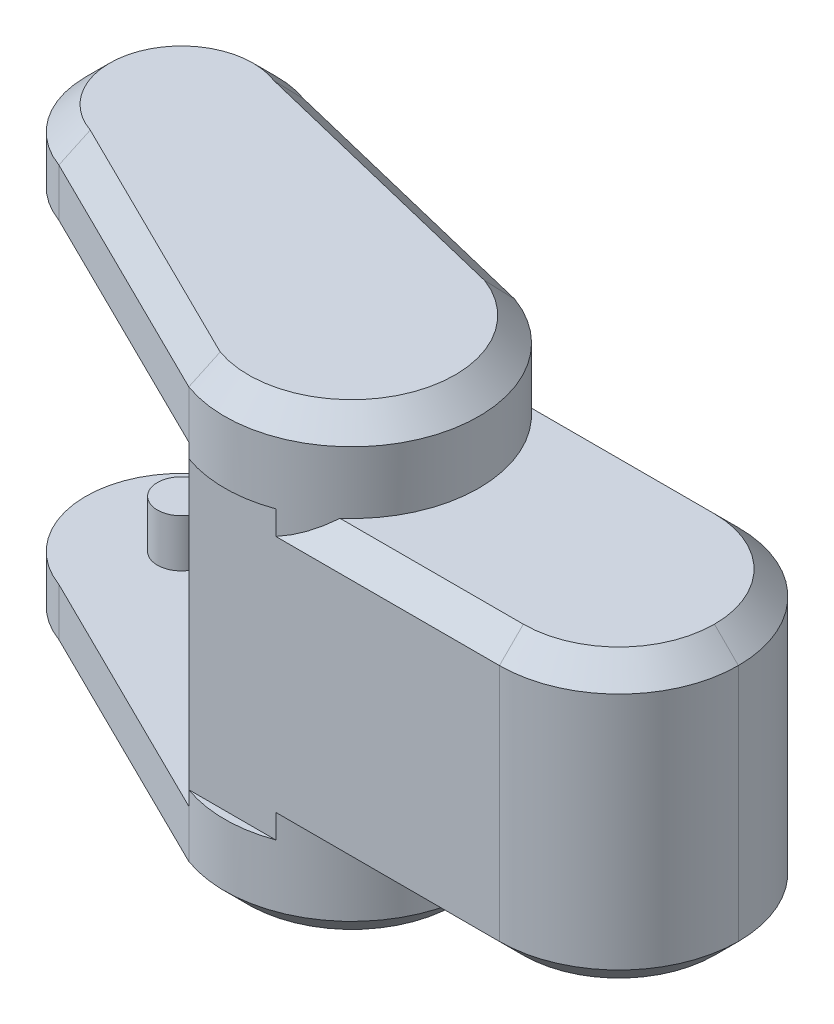
ISO-10303-21;
HEADER;
FILE_DESCRIPTION(('STEP AP214'),'2;1');
FILE_NAME('part.step','',(''),(''),'','','');
FILE_SCHEMA(('AUTOMOTIVE_DESIGN { 1 0 10303 214 1 1 1 1 }'));
ENDSEC;
DATA;
#1=APPLICATION_CONTEXT('core data for automotive mechanical design processes');
#2=APPLICATION_PROTOCOL_DEFINITION('international standard','automotive_design',2000,#1);
#3=PRODUCT_CONTEXT('',#1,'mechanical');
#4=PRODUCT('Part','Part','',(#3));
#5=PRODUCT_RELATED_PRODUCT_CATEGORY('part','',(#4));
#6=PRODUCT_DEFINITION_FORMATION('','',#4);
#7=PRODUCT_DEFINITION_CONTEXT('part definition',#1,'design');
#8=PRODUCT_DEFINITION('design','',#6,#7);
#9=PRODUCT_DEFINITION_SHAPE('','',#8);
#10=(LENGTH_UNIT() NAMED_UNIT(*) SI_UNIT(.MILLI.,.METRE.));
#11=(NAMED_UNIT(*) PLANE_ANGLE_UNIT() SI_UNIT($,.RADIAN.));
#12=(NAMED_UNIT(*) SI_UNIT($,.STERADIAN.) SOLID_ANGLE_UNIT());
#13=UNCERTAINTY_MEASURE_WITH_UNIT(LENGTH_MEASURE(1.E-05),#10,'distance_accuracy_value','');
#14=(GEOMETRIC_REPRESENTATION_CONTEXT(3) GLOBAL_UNCERTAINTY_ASSIGNED_CONTEXT((#13)) GLOBAL_UNIT_ASSIGNED_CONTEXT((#10,
#11,#12)) REPRESENTATION_CONTEXT('',''));
#15=CARTESIAN_POINT('',(0.,0.,0.));
#16=DIRECTION('',(0.,0.,1.));
#17=DIRECTION('',(1.,0.,0.));
#18=AXIS2_PLACEMENT_3D('',#15,#16,#17);
#19=CARTESIAN_POINT('',(0.,60.,0.));
#20=DIRECTION('',(0.939692620785907,0.,0.342020143325672));
#21=DIRECTION('',(0.342020143325672,0.,-0.939692620785907));
#22=AXIS2_PLACEMENT_3D('',#19,#20,#21);
#23=PLANE('',#22);
#24=DIRECTION('',(-0.342020143325673,0.,0.939692620785907));
#25=VECTOR('',#24,1.);
#26=CARTESIAN_POINT('',(0.,-3.,0.));
#27=LINE('',#26,#25);
#28=CARTESIAN_POINT('',(18.1985117133103,-3.,-50.));
#29=VERTEX_POINT('',#28);
#30=CARTESIAN_POINT('',(0.,-3.,0.));
#31=VERTEX_POINT('',#30);
#32=EDGE_CURVE('E223',#29,#31,#27,.T.);
#33=ORIENTED_EDGE('',*,*,#32,.T.);
#34=DIRECTION('',(0.,1.,0.));
#35=VECTOR('',#34,1.);
#36=CARTESIAN_POINT('',(0.,-18.,0.));
#37=LINE('',#36,#35);
#38=CARTESIAN_POINT('',(0.,0.,0.));
#39=VERTEX_POINT('',#38);
#40=EDGE_CURVE('E245',#31,#39,#37,.T.);
#41=ORIENTED_EDGE('',*,*,#40,.T.);
#42=DIRECTION('',(0.,-1.,0.));
#43=VECTOR('',#42,1.);
#44=CARTESIAN_POINT('',(0.,60.,0.));
#45=LINE('',#44,#43);
#46=CARTESIAN_POINT('',(0.,60.,0.));
#47=VERTEX_POINT('',#46);
#48=EDGE_CURVE('E282',#47,#39,#45,.T.);
#49=ORIENTED_EDGE('',*,*,#48,.F.);
#50=DIRECTION('',(0.,1.,0.));
#51=VECTOR('',#50,1.);
#52=CARTESIAN_POINT('',(0.,-2.75167630004557,0.));
#53=LINE('',#52,#51);
#54=CARTESIAN_POINT('',(0.,63.,0.));
#55=VERTEX_POINT('',#54);
#56=EDGE_CURVE('E263',#47,#55,#53,.T.);
#57=ORIENTED_EDGE('',*,*,#56,.T.);
#58=DIRECTION('',(-0.342020143325673,0.,0.939692620785907));
#59=VECTOR('',#58,1.);
#60=CARTESIAN_POINT('',(18.1985117133103,63.,-50.));
#61=LINE('',#60,#59);
#62=CARTESIAN_POINT('',(18.1985117133103,63.,-50.));
#63=VERTEX_POINT('',#62);
#64=EDGE_CURVE('E254',#63,#55,#61,.T.);
#65=ORIENTED_EDGE('',*,*,#64,.F.);
#66=DIRECTION('',(0.,-1.,0.));
#67=VECTOR('',#66,1.);
#68=CARTESIAN_POINT('',(18.1985117133103,60.,-50.));
#69=LINE('',#68,#67);
#70=CARTESIAN_POINT('',(18.1985117133103,54.9999999999999,-50.));
#71=VERTEX_POINT('',#70);
#72=EDGE_CURVE('E288',#63,#71,#69,.T.);
#73=ORIENTED_EDGE('',*,*,#72,.T.);
#74=CARTESIAN_POINT('',(18.1985117133103,5.00000000000003,-50.));
#75=VERTEX_POINT('',#74);
#76=EDGE_CURVE('E287',#71,#75,#69,.T.);
#77=ORIENTED_EDGE('',*,*,#76,.T.);
#78=DIRECTION('',(0.,1.,0.));
#79=VECTOR('',#78,1.);
#80=CARTESIAN_POINT('',(18.1985117133103,-18.,-50.));
#81=LINE('',#80,#79);
#82=EDGE_CURVE('E242',#29,#75,#81,.T.);
#83=ORIENTED_EDGE('',*,*,#82,.F.);
#84=EDGE_LOOP('',(#33,#41,#49,#57,#65,#73,#77,#83));
#85=FACE_BOUND('',#84,.T.);
#86=ADVANCED_FACE('F39',(#85),#23,.F.);
#87=CARTESIAN_POINT('',(90.,60.,0.));
#88=DIRECTION('',(0.,0.,-1.));
#89=DIRECTION('',(-1.,0.,0.));
#90=AXIS2_PLACEMENT_3D('',#87,#88,#89);
#91=PLANE('',#90);
#92=DIRECTION('',(0.,1.,0.));
#93=VECTOR('',#92,1.);
#94=CARTESIAN_POINT('',(18.1985117133103,0.,0.));
#95=LINE('',#94,#93);
#96=CARTESIAN_POINT('',(18.1985117133103,0.,0.));
#97=VERTEX_POINT('',#96);
#98=CARTESIAN_POINT('',(18.1985117133103,5.00000000000003,0.));
#99=VERTEX_POINT('',#98);
#100=EDGE_CURVE('E56',#97,#99,#95,.T.);
#101=ORIENTED_EDGE('',*,*,#100,.T.);
#102=DIRECTION('',(1.,0.,0.));
#103=VECTOR('',#102,1.);
#104=CARTESIAN_POINT('',(90.,5.00000000000003,0.));
#105=LINE('',#104,#103);
#106=CARTESIAN_POINT('',(65.,5.00000000000003,0.));
#107=VERTEX_POINT('',#106);
#108=EDGE_CURVE('E344',#99,#107,#105,.T.);
#109=ORIENTED_EDGE('',*,*,#108,.T.);
#110=DIRECTION('',(0.,-1.,0.));
#111=VECTOR('',#110,1.);
#112=CARTESIAN_POINT('',(65.,60.,0.));
#113=LINE('',#112,#111);
#114=CARTESIAN_POINT('',(65.,54.9999999999999,0.));
#115=VERTEX_POINT('',#114);
#116=EDGE_CURVE('E291',#107,#115,#113,.F.);
#117=ORIENTED_EDGE('',*,*,#116,.T.);
#118=DIRECTION('',(-1.,0.,0.));
#119=VECTOR('',#118,1.);
#120=CARTESIAN_POINT('',(18.1985117133103,54.9999999999999,0.));
#121=LINE('',#120,#119);
#122=CARTESIAN_POINT('',(18.1985117133103,54.9999999999999,0.));
#123=VERTEX_POINT('',#122);
#124=EDGE_CURVE('E340',#115,#123,#121,.T.);
#125=ORIENTED_EDGE('',*,*,#124,.T.);
#126=DIRECTION('',(0.,1.,0.));
#127=VECTOR('',#126,1.);
#128=CARTESIAN_POINT('',(18.1985117133103,54.9999999999999,0.));
#129=LINE('',#128,#127);
#130=CARTESIAN_POINT('',(18.1985117133103,60.,0.));
#131=VERTEX_POINT('',#130);
#132=EDGE_CURVE('E338',#123,#131,#129,.T.);
#133=ORIENTED_EDGE('',*,*,#132,.T.);
#134=DIRECTION('',(1.,0.,0.));
#135=VECTOR('',#134,1.);
#136=CARTESIAN_POINT('',(90.,60.,0.));
#137=LINE('',#136,#135);
#138=EDGE_CURVE('E279',#47,#131,#137,.T.);
#139=ORIENTED_EDGE('',*,*,#138,.F.);
#140=ORIENTED_EDGE('',*,*,#48,.T.);
#141=DIRECTION('',(1.,0.,0.));
#142=VECTOR('',#141,1.);
#143=CARTESIAN_POINT('',(90.,0.,0.));
#144=LINE('',#143,#142);
#145=EDGE_CURVE('E283',#39,#97,#144,.T.);
#146=ORIENTED_EDGE('',*,*,#145,.T.);
#147=EDGE_LOOP('',(#101,#109,#117,#125,#133,#139,#140,#146));
#148=FACE_BOUND('',#147,.T.);
#149=ADVANCED_FACE('F543',(#148),#91,.F.);
#150=CARTESIAN_POINT('',(18.1985117133103,60.,-50.));
#151=DIRECTION('',(0.,0.,1.));
#152=DIRECTION('',(1.,0.,0.));
#153=AXIS2_PLACEMENT_3D('',#150,#151,#152);
#154=PLANE('',#153);
#155=DIRECTION('',(0.,-1.,0.));
#156=VECTOR('',#155,1.);
#157=CARTESIAN_POINT('',(65.,60.,-50.));
#158=LINE('',#157,#156);
#159=CARTESIAN_POINT('',(65.,54.9999999999999,-50.));
#160=VERTEX_POINT('',#159);
#161=CARTESIAN_POINT('',(65.,5.00000000000003,-50.));
#162=VERTEX_POINT('',#161);
#163=EDGE_CURVE('E294',#160,#162,#158,.T.);
#164=ORIENTED_EDGE('',*,*,#163,.T.);
#165=DIRECTION('',(-1.,0.,0.));
#166=VECTOR('',#165,1.);
#167=CARTESIAN_POINT('',(18.1985117133103,5.00000000000003,-50.));
#168=LINE('',#167,#166);
#169=EDGE_CURVE('E319',#162,#75,#168,.T.);
#170=ORIENTED_EDGE('',*,*,#169,.T.);
#171=ORIENTED_EDGE('',*,*,#76,.F.);
#172=DIRECTION('',(1.,0.,0.));
#173=VECTOR('',#172,1.);
#174=CARTESIAN_POINT('',(65.,54.9999999999999,-50.));
#175=LINE('',#174,#173);
#176=EDGE_CURVE('E317',#71,#160,#175,.T.);
#177=ORIENTED_EDGE('',*,*,#176,.T.);
#178=EDGE_LOOP('',(#164,#170,#171,#177));
#179=FACE_BOUND('',#178,.T.);
#180=ADVANCED_FACE('F520',(#179),#154,.F.);
#181=CARTESIAN_POINT('',(0.,60.,0.));
#182=DIRECTION('',(0.,1.,0.));
#183=DIRECTION('',(0.,0.,1.));
#184=AXIS2_PLACEMENT_3D('',#181,#182,#183);
#185=PLANE('',#184);
#186=CARTESIAN_POINT('',(65.,60.,-25.));
#187=DIRECTION('',(0.,1.,0.));
#188=DIRECTION('',(0.,0.,1.));
#189=AXIS2_PLACEMENT_3D('',#186,#187,#188);
#190=CIRCLE('',#189,20.);
#191=CARTESIAN_POINT('',(85.,60.,-25.));
#192=VERTEX_POINT('',#191);
#193=CARTESIAN_POINT('',(65.,60.,-45.));
#194=VERTEX_POINT('',#193);
#195=EDGE_CURVE('E350',#192,#194,#190,.T.);
#196=ORIENTED_EDGE('',*,*,#195,.T.);
#197=DIRECTION('',(-1.,0.,0.));
#198=VECTOR('',#197,1.);
#199=CARTESIAN_POINT('',(18.1985117133103,60.,-45.));
#200=LINE('',#199,#198);
#201=CARTESIAN_POINT('',(26.6433847077801,60.,-45.));
#202=VERTEX_POINT('',#201);
#203=EDGE_CURVE('E352',#194,#202,#200,.T.);
#204=ORIENTED_EDGE('',*,*,#203,.T.);
#205=CARTESIAN_POINT('',(9.09925585665517,60.,-25.));
#206=DIRECTION('',(0.,1.,0.));
#207=DIRECTION('',(0.,0.,1.));
#208=AXIS2_PLACEMENT_3D('',#205,#206,#207);
#209=CIRCLE('',#208,26.6044443118978);
#210=CARTESIAN_POINT('',(26.6433847077801,60.,-5.00000000000002));
#211=VERTEX_POINT('',#210);
#212=EDGE_CURVE('E272',#202,#211,#209,.F.);
#213=ORIENTED_EDGE('',*,*,#212,.T.);
#214=DIRECTION('',(1.,0.,0.));
#215=VECTOR('',#214,1.);
#216=CARTESIAN_POINT('',(65.,60.,-5.00000000000003));
#217=LINE('',#216,#215);
#218=CARTESIAN_POINT('',(65.,60.,-5.00000000000003));
#219=VERTEX_POINT('',#218);
#220=EDGE_CURVE('E346',#211,#219,#217,.T.);
#221=ORIENTED_EDGE('',*,*,#220,.T.);
#222=CARTESIAN_POINT('',(65.,60.,-25.));
#223=DIRECTION('',(0.,1.,0.));
#224=DIRECTION('',(0.,0.,1.));
#225=AXIS2_PLACEMENT_3D('',#222,#223,#224);
#226=CIRCLE('',#225,20.);
#227=EDGE_CURVE('E348',#219,#192,#226,.T.);
#228=ORIENTED_EDGE('',*,*,#227,.T.);
#229=EDGE_LOOP('',(#196,#204,#213,#221,#228));
#230=FACE_BOUND('',#229,.T.);
#231=ADVANCED_FACE('F573',(#230),#185,.T.);
#232=CARTESIAN_POINT('',(0.,0.,0.));
#233=DIRECTION('',(0.,1.,0.));
#234=DIRECTION('',(0.,0.,1.));
#235=AXIS2_PLACEMENT_3D('',#232,#233,#234);
#236=PLANE('',#235);
#237=CARTESIAN_POINT('',(65.,0.,-25.));
#238=DIRECTION('',(0.,-1.,0.));
#239=DIRECTION('',(0.,0.,-1.));
#240=AXIS2_PLACEMENT_3D('',#237,#238,#239);
#241=CIRCLE('',#240,5.);
#242=CARTESIAN_POINT('',(65.,0.,-30.));
#243=VERTEX_POINT('',#242);
#244=EDGE_CURVE('E232',#243,#243,#241,.T.);
#245=ORIENTED_EDGE('',*,*,#244,.F.);
#246=EDGE_LOOP('',(#245));
#247=FACE_BOUND('',#246,.T.);
#248=CARTESIAN_POINT('',(9.09925585665517,0.,-25.));
#249=DIRECTION('',(0.,-1.,0.));
#250=DIRECTION('',(0.,0.,1.));
#251=AXIS2_PLACEMENT_3D('',#248,#249,#250);
#252=CIRCLE('',#251,26.6044443118978);
#253=CARTESIAN_POINT('',(26.6433847077802,0.,-44.9999999999999));
#254=VERTEX_POINT('',#253);
#255=CARTESIAN_POINT('',(26.6433847077801,0.,-5.00000000000005));
#256=VERTEX_POINT('',#255);
#257=EDGE_CURVE('E239',#254,#256,#252,.T.);
#258=ORIENTED_EDGE('',*,*,#257,.F.);
#259=DIRECTION('',(1.,0.,0.));
#260=VECTOR('',#259,1.);
#261=CARTESIAN_POINT('',(0.,0.,-44.9999999999999));
#262=LINE('',#261,#260);
#263=CARTESIAN_POINT('',(65.,0.,-44.9999999999999));
#264=VERTEX_POINT('',#263);
#265=EDGE_CURVE('E328',#254,#264,#262,.T.);
#266=ORIENTED_EDGE('',*,*,#265,.T.);
#267=CARTESIAN_POINT('',(65.,0.,-25.));
#268=DIRECTION('',(0.,1.,0.));
#269=DIRECTION('',(0.,0.,1.));
#270=AXIS2_PLACEMENT_3D('',#267,#268,#269);
#271=CIRCLE('',#270,19.9999999999999);
#272=CARTESIAN_POINT('',(84.9999999999999,0.,-25.));
#273=VERTEX_POINT('',#272);
#274=EDGE_CURVE('E326',#264,#273,#271,.F.);
#275=ORIENTED_EDGE('',*,*,#274,.T.);
#276=CARTESIAN_POINT('',(65.,0.,-25.));
#277=DIRECTION('',(0.,1.,0.));
#278=DIRECTION('',(0.,0.,1.));
#279=AXIS2_PLACEMENT_3D('',#276,#277,#278);
#280=CIRCLE('',#279,19.9999999999999);
#281=CARTESIAN_POINT('',(65.,0.,-5.00000000000006));
#282=VERTEX_POINT('',#281);
#283=EDGE_CURVE('E324',#273,#282,#280,.F.);
#284=ORIENTED_EDGE('',*,*,#283,.T.);
#285=DIRECTION('',(-1.,0.,0.));
#286=VECTOR('',#285,1.);
#287=CARTESIAN_POINT('',(0.,0.,-5.00000000000006));
#288=LINE('',#287,#286);
#289=EDGE_CURVE('E322',#282,#256,#288,.T.);
#290=ORIENTED_EDGE('',*,*,#289,.T.);
#291=EDGE_LOOP('',(#258,#266,#275,#284,#290));
#292=FACE_BOUND('',#291,.T.);
#293=ADVANCED_FACE('F533',(#247,#292),#236,.F.);
#294=CARTESIAN_POINT('',(65.,60.,-25.));
#295=DIRECTION('',(0.,-1.,0.));
#296=DIRECTION('',(0.,0.,-1.));
#297=AXIS2_PLACEMENT_3D('',#294,#295,#296);
#298=CYLINDRICAL_SURFACE('',#297,25.);
#299=DIRECTION('',(0.,-1.,0.));
#300=VECTOR('',#299,1.);
#301=CARTESIAN_POINT('',(90.,60.,-25.));
#302=LINE('',#301,#300);
#303=CARTESIAN_POINT('',(90.,5.00000000000003,-25.));
#304=VERTEX_POINT('',#303);
#305=CARTESIAN_POINT('',(90.,54.9999999999999,-25.));
#306=VERTEX_POINT('',#305);
#307=EDGE_CURVE('E275',#304,#306,#302,.F.);
#308=ORIENTED_EDGE('',*,*,#307,.F.);
#309=CARTESIAN_POINT('',(65.,5.00000000000003,-25.));
#310=DIRECTION('',(0.,1.,0.));
#311=DIRECTION('',(0.,0.,1.));
#312=AXIS2_PLACEMENT_3D('',#309,#310,#311);
#313=CIRCLE('',#312,25.);
#314=EDGE_CURVE('E332',#304,#162,#313,.T.);
#315=ORIENTED_EDGE('',*,*,#314,.T.);
#316=ORIENTED_EDGE('',*,*,#163,.F.);
#317=CARTESIAN_POINT('',(65.,54.9999999999999,-25.));
#318=DIRECTION('',(0.,1.,0.));
#319=DIRECTION('',(0.,0.,1.));
#320=AXIS2_PLACEMENT_3D('',#317,#318,#319);
#321=CIRCLE('',#320,25.);
#322=EDGE_CURVE('E330',#160,#306,#321,.F.);
#323=ORIENTED_EDGE('',*,*,#322,.T.);
#324=EDGE_LOOP('',(#308,#315,#316,#323));
#325=FACE_BOUND('',#324,.T.);
#326=ADVANCED_FACE('F578',(#325),#298,.T.);
#327=CARTESIAN_POINT('',(65.,60.,-25.));
#328=DIRECTION('',(0.,-1.,0.));
#329=DIRECTION('',(0.,0.,-1.));
#330=AXIS2_PLACEMENT_3D('',#327,#328,#329);
#331=CYLINDRICAL_SURFACE('',#330,25.);
#332=ORIENTED_EDGE('',*,*,#116,.F.);
#333=CARTESIAN_POINT('',(65.,5.00000000000003,-25.));
#334=DIRECTION('',(0.,1.,0.));
#335=DIRECTION('',(0.,0.,1.));
#336=AXIS2_PLACEMENT_3D('',#333,#334,#335);
#337=CIRCLE('',#336,25.);
#338=EDGE_CURVE('E336',#107,#304,#337,.T.);
#339=ORIENTED_EDGE('',*,*,#338,.T.);
#340=ORIENTED_EDGE('',*,*,#307,.T.);
#341=CARTESIAN_POINT('',(65.,54.9999999999999,-25.));
#342=DIRECTION('',(0.,1.,0.));
#343=DIRECTION('',(0.,0.,1.));
#344=AXIS2_PLACEMENT_3D('',#341,#342,#343);
#345=CIRCLE('',#344,25.);
#346=EDGE_CURVE('E334',#306,#115,#345,.F.);
#347=ORIENTED_EDGE('',*,*,#346,.T.);
#348=EDGE_LOOP('',(#332,#339,#340,#347));
#349=FACE_BOUND('',#348,.T.);
#350=ADVANCED_FACE('F575',(#349),#331,.T.);
#351=CARTESIAN_POINT('',(0.,60.,0.));
#352=DIRECTION('',(0.,1.,0.));
#353=DIRECTION('',(0.,0.,1.));
#354=AXIS2_PLACEMENT_3D('',#351,#352,#353);
#355=PLANE('',#354);
#356=EDGE_CURVE('E276',#131,#47,#209,.F.);
#357=ORIENTED_EDGE('',*,*,#356,.T.);
#358=ORIENTED_EDGE('',*,*,#138,.T.);
#359=EDGE_LOOP('',(#357,#358));
#360=FACE_BOUND('',#359,.T.);
#361=ADVANCED_FACE('F577',(#360),#355,.F.);
#362=CARTESIAN_POINT('',(9.09925585665517,-2.75167630004557,-25.));
#363=DIRECTION('',(0.,1.,0.));
#364=DIRECTION('',(0.,0.,1.));
#365=AXIS2_PLACEMENT_3D('',#362,#363,#364);
#366=CYLINDRICAL_SURFACE('',#365,26.6044443118978);
#367=DIRECTION('',(0.,1.,0.));
#368=VECTOR('',#367,1.);
#369=CARTESIAN_POINT('',(18.1985117133103,63.,-50.));
#370=LINE('',#369,#368);
#371=CARTESIAN_POINT('',(18.1985117133103,73.,-50.));
#372=VERTEX_POINT('',#371);
#373=EDGE_CURVE('E264',#63,#372,#370,.T.);
#374=ORIENTED_EDGE('',*,*,#373,.T.);
#375=CARTESIAN_POINT('',(9.09925585665517,73.,-25.));
#376=DIRECTION('',(0.,-1.,0.));
#377=DIRECTION('',(0.,0.,-1.));
#378=AXIS2_PLACEMENT_3D('',#375,#376,#377);
#379=CIRCLE('',#378,26.6044443118978);
#380=CARTESIAN_POINT('',(0.,73.,0.));
#381=VERTEX_POINT('',#380);
#382=EDGE_CURVE('E315',#372,#381,#379,.T.);
#383=ORIENTED_EDGE('',*,*,#382,.T.);
#384=DIRECTION('',(0.,1.,0.));
#385=VECTOR('',#384,1.);
#386=CARTESIAN_POINT('',(0.,63.,0.));
#387=LINE('',#386,#385);
#388=EDGE_CURVE('E267',#55,#381,#387,.T.);
#389=ORIENTED_EDGE('',*,*,#388,.F.);
#390=ORIENTED_EDGE('',*,*,#56,.F.);
#391=ORIENTED_EDGE('',*,*,#356,.F.);
#392=ORIENTED_EDGE('',*,*,#132,.F.);
#393=CARTESIAN_POINT('',(9.09925585665517,80.0000000000001,-25.));
#394=DIRECTION('',(0.,0.707106781186545,0.70710678118655));
#395=DIRECTION('',(0.,0.70710678118655,-0.707106781186545));
#396=AXIS2_PLACEMENT_3D('',#393,#394,#395);
#397=ELLIPSE('',#396,37.6243659652858,26.6044443118978);
#398=EDGE_CURVE('E49',#123,#211,#397,.T.);
#399=ORIENTED_EDGE('',*,*,#398,.T.);
#400=ORIENTED_EDGE('',*,*,#212,.F.);
#401=CARTESIAN_POINT('',(9.09925585665517,80.0000000000001,-25.));
#402=DIRECTION('',(0.,0.707106781186546,-0.707106781186549));
#403=DIRECTION('',(0.,0.707106781186549,0.707106781186546));
#404=AXIS2_PLACEMENT_3D('',#401,#402,#403);
#405=ELLIPSE('',#404,37.6243659652858,26.6044443118978);
#406=EDGE_CURVE('E375',#202,#71,#405,.T.);
#407=ORIENTED_EDGE('',*,*,#406,.T.);
#408=ORIENTED_EDGE('',*,*,#72,.F.);
#409=EDGE_LOOP('',(#374,#383,#389,#390,#391,#392,#399,#400,#407,#408));
#410=FACE_BOUND('',#409,.T.);
#411=ADVANCED_FACE('F607',(#410),#366,.T.);
#412=CARTESIAN_POINT('',(9.09925585665517,78.,-25.));
#413=DIRECTION('',(0.,-1.,0.));
#414=DIRECTION('',(0.,0.,-1.));
#415=AXIS2_PLACEMENT_3D('',#412,#413,#414);
#416=PLANE('',#415);
#417=CARTESIAN_POINT('',(-46.9584553050064,78.,-45.4033382639373));
#418=DIRECTION('',(0.,-1.,0.));
#419=DIRECTION('',(0.,0.,-1.));
#420=AXIS2_PLACEMENT_3D('',#417,#418,#419);
#421=CIRCLE('',#420,15.);
#422=CARTESIAN_POINT('',(-41.5881784331691,78.,-59.4090558935274));
#423=VERTEX_POINT('',#422);
#424=CARTESIAN_POINT('',(-51.847286306394,78.,-31.2223886680932));
#425=VERTEX_POINT('',#424);
#426=EDGE_CURVE('E303',#423,#425,#421,.F.);
#427=ORIENTED_EDGE('',*,*,#426,.T.);
#428=DIRECTION('',(0.896351157612325,0.,0.443344789353663));
#429=VECTOR('',#428,1.);
#430=CARTESIAN_POINT('',(2.21672394676832,78.,-4.48175578806166));
#431=LINE('',#430,#429);
#432=CARTESIAN_POINT('',(1.95648776542577,78.,-4.61047136344714));
#433=VERTEX_POINT('',#432);
#434=EDGE_CURVE('E305',#425,#433,#431,.T.);
#435=ORIENTED_EDGE('',*,*,#434,.T.);
#436=CARTESIAN_POINT('',(9.09925585665517,78.,-25.));
#437=DIRECTION('',(0.,-1.,0.));
#438=DIRECTION('',(0.,0.,-1.));
#439=AXIS2_PLACEMENT_3D('',#436,#437,#438);
#440=CIRCLE('',#439,21.6044443118978);
#441=CARTESIAN_POINT('',(16.7337144268065,78.,-45.2105679377532));
#442=VERTEX_POINT('',#441);
#443=EDGE_CURVE('E297',#433,#442,#440,.F.);
#444=ORIENTED_EDGE('',*,*,#443,.T.);
#445=DIRECTION('',(-0.971621360787807,0.,-0.23654160577127));
#446=VECTOR('',#445,1.);
#447=CARTESIAN_POINT('',(14.1713906880756,78.,-45.8343666685405));
#448=LINE('',#447,#446);
#449=EDGE_CURVE('E301',#442,#423,#448,.T.);
#450=ORIENTED_EDGE('',*,*,#449,.T.);
#451=EDGE_LOOP('',(#427,#435,#444,#450));
#452=FACE_BOUND('',#451,.T.);
#453=ADVANCED_FACE('F615',(#452),#416,.F.);
#454=CARTESIAN_POINT('',(-46.9584553050064,63.,-45.4033382639373));
#455=DIRECTION('',(0.,1.,0.));
#456=DIRECTION('',(0.,0.,1.));
#457=AXIS2_PLACEMENT_3D('',#454,#455,#456);
#458=CYLINDRICAL_SURFACE('',#457,20.);
#459=DIRECTION('',(0.,1.,0.));
#460=VECTOR('',#459,1.);
#461=CARTESIAN_POINT('',(-53.7988581715198,63.,-26.6094858482192));
#462=LINE('',#461,#460);
#463=CARTESIAN_POINT('',(-53.7988581715198,63.,-26.6094858482192));
#464=VERTEX_POINT('',#463);
#465=CARTESIAN_POINT('',(-53.7988581715198,73.,-26.6094858482192));
#466=VERTEX_POINT('',#465);
#467=EDGE_CURVE('E259',#464,#466,#462,.T.);
#468=ORIENTED_EDGE('',*,*,#467,.T.);
#469=CARTESIAN_POINT('',(-46.9584553050064,73.,-45.4033382639373));
#470=DIRECTION('',(0.,-1.,0.));
#471=DIRECTION('',(0.,0.,-1.));
#472=AXIS2_PLACEMENT_3D('',#469,#470,#471);
#473=CIRCLE('',#472,20.);
#474=CARTESIAN_POINT('',(-40.1180524384929,73.,-64.1971906796555));
#475=VERTEX_POINT('',#474);
#476=EDGE_CURVE('E311',#466,#475,#473,.T.);
#477=ORIENTED_EDGE('',*,*,#476,.T.);
#478=DIRECTION('',(0.,1.,0.));
#479=VECTOR('',#478,1.);
#480=CARTESIAN_POINT('',(-40.1180524384929,63.,-64.1971906796555));
#481=LINE('',#480,#479);
#482=CARTESIAN_POINT('',(-40.1180524384929,63.,-64.1971906796555));
#483=VERTEX_POINT('',#482);
#484=EDGE_CURVE('E260',#483,#475,#481,.T.);
#485=ORIENTED_EDGE('',*,*,#484,.F.);
#486=CARTESIAN_POINT('',(-46.9584553050064,63.,-45.4033382639373));
#487=DIRECTION('',(0.,1.,0.));
#488=DIRECTION('',(0.,0.,1.));
#489=AXIS2_PLACEMENT_3D('',#486,#487,#488);
#490=CIRCLE('',#489,20.);
#491=EDGE_CURVE('E248',#483,#464,#490,.T.);
#492=ORIENTED_EDGE('',*,*,#491,.T.);
#493=EDGE_LOOP('',(#468,#477,#485,#492));
#494=FACE_BOUND('',#493,.T.);
#495=ADVANCED_FACE('F619',(#494),#458,.T.);
#496=CARTESIAN_POINT('',(-40.1180524384929,63.,-64.1971906796555));
#497=DIRECTION('',(-0.23654160577127,0.,0.971621360787807));
#498=DIRECTION('',(0.971621360787807,0.,0.23654160577127));
#499=AXIS2_PLACEMENT_3D('',#496,#497,#498);
#500=PLANE('',#499);
#501=ORIENTED_EDGE('',*,*,#484,.T.);
#502=DIRECTION('',(0.971621360787807,0.,0.23654160577127));
#503=VECTOR('',#502,1.);
#504=CARTESIAN_POINT('',(-40.1180524384929,73.,-64.1971906796555));
#505=LINE('',#504,#503);
#506=EDGE_CURVE('E313',#475,#372,#505,.T.);
#507=ORIENTED_EDGE('',*,*,#506,.T.);
#508=ORIENTED_EDGE('',*,*,#373,.F.);
#509=DIRECTION('',(0.971621360787807,0.,0.23654160577127));
#510=VECTOR('',#509,1.);
#511=CARTESIAN_POINT('',(-40.1180524384929,63.,-64.1971906796555));
#512=LINE('',#511,#510);
#513=EDGE_CURVE('E256',#483,#63,#512,.T.);
#514=ORIENTED_EDGE('',*,*,#513,.F.);
#515=EDGE_LOOP('',(#501,#507,#508,#514));
#516=FACE_BOUND('',#515,.T.);
#517=ADVANCED_FACE('F879',(#516),#500,.F.);
#518=CARTESIAN_POINT('',(-53.7988581715198,63.,-26.6094858482192));
#519=DIRECTION('',(-0.443344789353663,0.,0.896351157612325));
#520=DIRECTION('',(0.896351157612325,0.,0.443344789353663));
#521=AXIS2_PLACEMENT_3D('',#518,#519,#520);
#522=PLANE('',#521);
#523=ORIENTED_EDGE('',*,*,#388,.T.);
#524=DIRECTION('',(-0.896351157612325,0.,-0.443344789353663));
#525=VECTOR('',#524,1.);
#526=CARTESIAN_POINT('',(-53.7988581715198,73.,-26.6094858482192));
#527=LINE('',#526,#525);
#528=EDGE_CURVE('E308',#381,#466,#527,.T.);
#529=ORIENTED_EDGE('',*,*,#528,.T.);
#530=ORIENTED_EDGE('',*,*,#467,.F.);
#531=DIRECTION('',(0.896351157612325,0.,0.443344789353663));
#532=VECTOR('',#531,1.);
#533=CARTESIAN_POINT('',(-53.7988581715198,63.,-26.6094858482192));
#534=LINE('',#533,#532);
#535=EDGE_CURVE('E251',#464,#55,#534,.T.);
#536=ORIENTED_EDGE('',*,*,#535,.T.);
#537=EDGE_LOOP('',(#523,#529,#530,#536));
#538=FACE_BOUND('',#537,.T.);
#539=ADVANCED_FACE('F559',(#538),#522,.T.);
#540=CARTESIAN_POINT('',(-46.9584553050064,63.,-45.4033382639373));
#541=DIRECTION('',(0.,1.,0.));
#542=DIRECTION('',(0.,0.,1.));
#543=AXIS2_PLACEMENT_3D('',#540,#541,#542);
#544=PLANE('',#543);
#545=ORIENTED_EDGE('',*,*,#491,.F.);
#546=ORIENTED_EDGE('',*,*,#513,.T.);
#547=ORIENTED_EDGE('',*,*,#64,.T.);
#548=ORIENTED_EDGE('',*,*,#535,.F.);
#549=EDGE_LOOP('',(#545,#546,#547,#548));
#550=FACE_BOUND('',#549,.T.);
#551=ADVANCED_FACE('F551',(#550),#544,.F.);
#552=CARTESIAN_POINT('',(9.09925585665517,0.,-25.));
#553=DIRECTION('',(0.,1.,0.));
#554=DIRECTION('',(0.,0.,1.));
#555=AXIS2_PLACEMENT_3D('',#552,#553,#554);
#556=PLANE('',#555);
#557=ORIENTED_EDGE('',*,*,#145,.F.);
#558=EDGE_CURVE('E237',#97,#39,#252,.T.);
#559=ORIENTED_EDGE('',*,*,#558,.F.);
#560=EDGE_LOOP('',(#557,#559));
#561=FACE_BOUND('',#560,.T.);
#562=ADVANCED_FACE('F549',(#561),#556,.T.);
#563=CARTESIAN_POINT('',(9.09925585665517,-18.,-25.));
#564=DIRECTION('',(0.,1.,0.));
#565=DIRECTION('',(0.,0.,1.));
#566=AXIS2_PLACEMENT_3D('',#563,#564,#565);
#567=CYLINDRICAL_SURFACE('',#566,26.6044443118978);
#568=CARTESIAN_POINT('',(0.,-12.9999999999999,0.));
#569=VERTEX_POINT('',#568);
#570=EDGE_CURVE('E246',#569,#31,#37,.T.);
#571=ORIENTED_EDGE('',*,*,#570,.F.);
#572=CARTESIAN_POINT('',(9.09925585665517,-12.9999999999999,-25.));
#573=DIRECTION('',(0.,1.,0.));
#574=DIRECTION('',(0.,0.,1.));
#575=AXIS2_PLACEMENT_3D('',#572,#573,#574);
#576=CIRCLE('',#575,26.6044443118978);
#577=CARTESIAN_POINT('',(18.1985117133103,-12.9999999999999,-50.));
#578=VERTEX_POINT('',#577);
#579=EDGE_CURVE('E364',#569,#578,#576,.T.);
#580=ORIENTED_EDGE('',*,*,#579,.T.);
#581=EDGE_CURVE('E243',#578,#29,#81,.T.);
#582=ORIENTED_EDGE('',*,*,#581,.T.);
#583=ORIENTED_EDGE('',*,*,#82,.T.);
#584=CARTESIAN_POINT('',(9.09925585665517,-19.9999999999998,-25.));
#585=DIRECTION('',(0.,0.707106781186549,0.707106781186546));
#586=DIRECTION('',(0.,0.707106781186546,-0.707106781186549));
#587=AXIS2_PLACEMENT_3D('',#584,#585,#586);
#588=ELLIPSE('',#587,37.6243659652856,26.6044443118978);
#589=EDGE_CURVE('E371',#75,#254,#588,.F.);
#590=ORIENTED_EDGE('',*,*,#589,.T.);
#591=ORIENTED_EDGE('',*,*,#257,.T.);
#592=CARTESIAN_POINT('',(9.09925585665517,-19.9999999999999,-25.));
#593=DIRECTION('',(0.,0.707106781186549,-0.707106781186546));
#594=DIRECTION('',(0.,0.707106781186546,0.707106781186549));
#595=AXIS2_PLACEMENT_3D('',#592,#593,#594);
#596=ELLIPSE('',#595,37.6243659652856,26.6044443118978);
#597=EDGE_CURVE('E373',#256,#99,#596,.F.);
#598=ORIENTED_EDGE('',*,*,#597,.T.);
#599=ORIENTED_EDGE('',*,*,#100,.F.);
#600=ORIENTED_EDGE('',*,*,#558,.T.);
#601=ORIENTED_EDGE('',*,*,#40,.F.);
#602=EDGE_LOOP('',(#571,#580,#582,#583,#590,#591,#598,#599,#600,#601));
#603=FACE_BOUND('',#602,.T.);
#604=ADVANCED_FACE('F505',(#603),#567,.T.);
#605=CARTESIAN_POINT('',(9.09925585665517,-18.,-25.));
#606=DIRECTION('',(0.,1.,0.));
#607=DIRECTION('',(0.,0.,1.));
#608=AXIS2_PLACEMENT_3D('',#605,#606,#607);
#609=PLANE('',#608);
#610=DIRECTION('',(0.971621360787807,0.,0.23654160577127));
#611=VECTOR('',#610,1.);
#612=CARTESIAN_POINT('',(17.015803684454,-18.,-45.1418931960609));
#613=LINE('',#612,#611);
#614=CARTESIAN_POINT('',(-41.5881784331691,-18.,-59.4090558935274));
#615=VERTEX_POINT('',#614);
#616=CARTESIAN_POINT('',(16.7337144268065,-18.,-45.2105679377532));
#617=VERTEX_POINT('',#616);
#618=EDGE_CURVE('E359',#615,#617,#613,.T.);
#619=ORIENTED_EDGE('',*,*,#618,.T.);
#620=CARTESIAN_POINT('',(9.09925585665517,-18.,-25.));
#621=DIRECTION('',(0.,1.,0.));
#622=DIRECTION('',(0.,0.,1.));
#623=AXIS2_PLACEMENT_3D('',#620,#621,#622);
#624=CIRCLE('',#623,21.6044443118978);
#625=CARTESIAN_POINT('',(1.95648776542573,-18.,-4.61047136344716));
#626=VERTEX_POINT('',#625);
#627=EDGE_CURVE('E361',#617,#626,#624,.F.);
#628=ORIENTED_EDGE('',*,*,#627,.T.);
#629=DIRECTION('',(-0.896351157612325,0.,-0.443344789353663));
#630=VECTOR('',#629,1.);
#631=CARTESIAN_POINT('',(-51.5821342247515,-18.,-31.0912416362808));
#632=LINE('',#631,#630);
#633=CARTESIAN_POINT('',(-51.8472863063939,-18.,-31.2223886680932));
#634=VERTEX_POINT('',#633);
#635=EDGE_CURVE('E355',#626,#634,#632,.T.);
#636=ORIENTED_EDGE('',*,*,#635,.T.);
#637=CARTESIAN_POINT('',(-46.9584553050064,-18.,-45.4033382639373));
#638=DIRECTION('',(0.,1.,0.));
#639=DIRECTION('',(0.,0.,1.));
#640=AXIS2_PLACEMENT_3D('',#637,#638,#639);
#641=CIRCLE('',#640,15.);
#642=EDGE_CURVE('E357',#634,#615,#641,.F.);
#643=ORIENTED_EDGE('',*,*,#642,.T.);
#644=EDGE_LOOP('',(#619,#628,#636,#643));
#645=FACE_BOUND('',#644,.T.);
#646=ADVANCED_FACE('F557',(#645),#609,.F.);
#647=CARTESIAN_POINT('',(-46.9584553050064,-3.,-45.4033382639373));
#648=DIRECTION('',(0.,-1.,0.));
#649=DIRECTION('',(0.,0.,-1.));
#650=AXIS2_PLACEMENT_3D('',#647,#648,#649);
#651=CYLINDRICAL_SURFACE('',#650,20.);
#652=DIRECTION('',(0.,-1.,0.));
#653=VECTOR('',#652,1.);
#654=CARTESIAN_POINT('',(-40.1180524384929,-3.,-64.1971906796555));
#655=LINE('',#654,#653);
#656=CARTESIAN_POINT('',(-40.1180524384929,-3.,-64.1971906796555));
#657=VERTEX_POINT('',#656);
#658=CARTESIAN_POINT('',(-40.1180524384929,-12.9999999999999,-64.1971906796555));
#659=VERTEX_POINT('',#658);
#660=EDGE_CURVE('E203',#657,#659,#655,.T.);
#661=ORIENTED_EDGE('',*,*,#660,.T.);
#662=CARTESIAN_POINT('',(-46.9584553050064,-12.9999999999999,-45.4033382639373));
#663=DIRECTION('',(0.,1.,0.));
#664=DIRECTION('',(0.,0.,1.));
#665=AXIS2_PLACEMENT_3D('',#662,#663,#664);
#666=CIRCLE('',#665,20.);
#667=CARTESIAN_POINT('',(-53.7988581715198,-12.9999999999999,-26.6094858482192));
#668=VERTEX_POINT('',#667);
#669=EDGE_CURVE('E64',#659,#668,#666,.T.);
#670=ORIENTED_EDGE('',*,*,#669,.T.);
#671=DIRECTION('',(0.,-1.,0.));
#672=VECTOR('',#671,1.);
#673=CARTESIAN_POINT('',(-53.7988581715198,-3.,-26.6094858482192));
#674=LINE('',#673,#672);
#675=CARTESIAN_POINT('',(-53.7988581715198,-3.,-26.6094858482192));
#676=VERTEX_POINT('',#675);
#677=EDGE_CURVE('E212',#676,#668,#674,.T.);
#678=ORIENTED_EDGE('',*,*,#677,.F.);
#679=CARTESIAN_POINT('',(-46.9584553050064,-3.,-45.4033382639373));
#680=DIRECTION('',(0.,-1.,0.));
#681=DIRECTION('',(0.,0.,-1.));
#682=AXIS2_PLACEMENT_3D('',#679,#680,#681);
#683=CIRCLE('',#682,20.);
#684=EDGE_CURVE('E220',#676,#657,#683,.T.);
#685=ORIENTED_EDGE('',*,*,#684,.T.);
#686=EDGE_LOOP('',(#661,#670,#678,#685));
#687=FACE_BOUND('',#686,.T.);
#688=ADVANCED_FACE('F225',(#687),#651,.T.);
#689=CARTESIAN_POINT('',(-53.7988581715198,-3.,-26.6094858482192));
#690=DIRECTION('',(-0.443344789353663,0.,0.896351157612325));
#691=DIRECTION('',(0.896351157612325,0.,0.443344789353663));
#692=AXIS2_PLACEMENT_3D('',#689,#690,#691);
#693=PLANE('',#692);
#694=ORIENTED_EDGE('',*,*,#677,.T.);
#695=DIRECTION('',(0.896351157612325,0.,0.443344789353663));
#696=VECTOR('',#695,1.);
#697=CARTESIAN_POINT('',(0.,-12.9999999999999,0.));
#698=LINE('',#697,#696);
#699=EDGE_CURVE('E369',#668,#569,#698,.T.);
#700=ORIENTED_EDGE('',*,*,#699,.T.);
#701=ORIENTED_EDGE('',*,*,#570,.T.);
#702=DIRECTION('',(-0.896351157612325,0.,-0.443344789353663));
#703=VECTOR('',#702,1.);
#704=CARTESIAN_POINT('',(-53.7988581715198,-3.,-26.6094858482192));
#705=LINE('',#704,#703);
#706=EDGE_CURVE('E213',#31,#676,#705,.T.);
#707=ORIENTED_EDGE('',*,*,#706,.T.);
#708=EDGE_LOOP('',(#694,#700,#701,#707));
#709=FACE_BOUND('',#708,.T.);
#710=ADVANCED_FACE('F508',(#709),#693,.T.);
#711=CARTESIAN_POINT('',(18.1985117133103,-3.,-50.));
#712=DIRECTION('',(0.23654160577127,0.,-0.971621360787807));
#713=DIRECTION('',(-0.971621360787807,0.,-0.23654160577127));
#714=AXIS2_PLACEMENT_3D('',#711,#712,#713);
#715=PLANE('',#714);
#716=ORIENTED_EDGE('',*,*,#581,.F.);
#717=DIRECTION('',(-0.971621360787807,0.,-0.23654160577127));
#718=VECTOR('',#717,1.);
#719=CARTESIAN_POINT('',(-40.1180524384929,-12.9999999999999,-64.1971906796555));
#720=LINE('',#719,#718);
#721=EDGE_CURVE('E210',#578,#659,#720,.T.);
#722=ORIENTED_EDGE('',*,*,#721,.T.);
#723=ORIENTED_EDGE('',*,*,#660,.F.);
#724=DIRECTION('',(0.971621360787807,0.,0.23654160577127));
#725=VECTOR('',#724,1.);
#726=CARTESIAN_POINT('',(18.1985117133103,-3.,-50.));
#727=LINE('',#726,#725);
#728=EDGE_CURVE('E207',#657,#29,#727,.T.);
#729=ORIENTED_EDGE('',*,*,#728,.T.);
#730=EDGE_LOOP('',(#716,#722,#723,#729));
#731=FACE_BOUND('',#730,.T.);
#732=ADVANCED_FACE('F206',(#731),#715,.T.);
#733=CARTESIAN_POINT('',(-46.9584553050064,-3.,-45.4033382639373));
#734=DIRECTION('',(0.,-1.,0.));
#735=DIRECTION('',(0.,0.,-1.));
#736=AXIS2_PLACEMENT_3D('',#733,#734,#735);
#737=PLANE('',#736);
#738=CARTESIAN_POINT('',(-46.9584553050064,-3.,-45.4033382639373));
#739=DIRECTION('',(0.,-1.,0.));
#740=DIRECTION('',(0.,0.,-1.));
#741=AXIS2_PLACEMENT_3D('',#738,#739,#740);
#742=CIRCLE('',#741,5.);
#743=CARTESIAN_POINT('',(-46.9584553050064,-3.,-50.4033382639373));
#744=VERTEX_POINT('',#743);
#745=EDGE_CURVE('E11',#744,#744,#742,.F.);
#746=ORIENTED_EDGE('',*,*,#745,.F.);
#747=EDGE_LOOP('',(#746));
#748=FACE_BOUND('',#747,.T.);
#749=ORIENTED_EDGE('',*,*,#684,.F.);
#750=ORIENTED_EDGE('',*,*,#706,.F.);
#751=ORIENTED_EDGE('',*,*,#32,.F.);
#752=ORIENTED_EDGE('',*,*,#728,.F.);
#753=EDGE_LOOP('',(#749,#750,#751,#752));
#754=FACE_BOUND('',#753,.T.);
#755=ADVANCED_FACE('F218',(#748,#754),#737,.F.);
#756=CARTESIAN_POINT('',(-40.1180524384929,73.,-64.1971906796555));
#757=DIRECTION('',(-0.16726017347362,-0.707106781186548,0.687040052958759));
#758=DIRECTION('',(0.971621360787807,0.,0.23654160577127));
#759=AXIS2_PLACEMENT_3D('',#756,#757,#758);
#760=PLANE('',#759);
#761=CARTESIAN_POINT('',(18.1985117133103,73.,-50.));
#762=CARTESIAN_POINT('',(17.9568087156999,73.8334063574149,-49.2010946099302));
#763=CARTESIAN_POINT('',(17.7138907909673,74.666776153399,-48.4025226236493));
#764=CARTESIAN_POINT('',(17.2256250293754,76.333442820083,-46.806045269409));
#765=CARTESIAN_POINT('',(16.9802771919401,77.1667396907656,-46.0081399016075));
#766=CARTESIAN_POINT('',(16.7337144268065,78.,-45.2105679377532));
#767=B_SPLINE_CURVE_WITH_KNOTS('',3,(#761,#762,#763,#764,#765,#766),.UNSPECIFIED.,.F.,.F.,(4,2,
4),(0.,3.53851437337584,7.07702958570844),.UNSPECIFIED.);
#768=EDGE_CURVE('E229',#372,#442,#767,.T.);
#769=ORIENTED_EDGE('',*,*,#768,.F.);
#770=ORIENTED_EDGE('',*,*,#506,.F.);
#771=CARTESIAN_POINT('',(-40.1180524384929,73.,-64.1971906796555));
#772=CARTESIAN_POINT('',(-40.3596572324369,73.8334378233619,-63.3982289968751));
#773=CARTESIAN_POINT('',(-40.6029700888266,74.6668232670895,-62.5997370520878));
#774=CARTESIAN_POINT('',(-41.0930120848443,76.3334899338238,-61.0036921227713));
#775=CARTESIAN_POINT('',(-41.33974122668,77.1667711567629,-60.2061391388493));
#776=CARTESIAN_POINT('',(-41.5881784331691,78.,-59.4090558935274));
#777=B_SPLINE_CURVE_WITH_KNOTS('',3,(#771,#772,#773,#774,#775,#776),.UNSPECIFIED.,.F.,.F.,(4,2,
4),(0.,3.53862917923407,7.07726064533371),.UNSPECIFIED.);
#778=EDGE_CURVE('E226',#423,#475,#777,.F.);
#779=ORIENTED_EDGE('',*,*,#778,.F.);
#780=ORIENTED_EDGE('',*,*,#449,.F.);
#781=EDGE_LOOP('',(#769,#770,#779,#780));
#782=FACE_BOUND('',#781,.T.);
#783=ADVANCED_FACE('F415',(#782),#760,.F.);
#784=CARTESIAN_POINT('',(-46.9584553050064,78.,-45.4033382639373));
#785=DIRECTION('',(0.,-1.,0.));
#786=DIRECTION('',(0.,0.,-1.));
#787=AXIS2_PLACEMENT_3D('',#784,#785,#786);
#788=CONICAL_SURFACE('',#787,15.,0.785398163397449);
#789=ORIENTED_EDGE('',*,*,#778,.T.);
#790=ORIENTED_EDGE('',*,*,#476,.F.);
#791=CARTESIAN_POINT('',(-53.7988581715198,73.,-26.6094858482192));
#792=CARTESIAN_POINT('',(-53.470375511046,73.8334378233619,-27.3768265735661));
#793=CARTESIAN_POINT('',(-53.1435032440789,74.6668232670895,-28.1449053801105));
#794=CARTESIAN_POINT('',(-52.4929792869555,76.3334899338239,-29.6825396524478));
#795=CARTESIAN_POINT('',(-52.1693275988806,77.1667711567629,-30.4520951191948));
#796=CARTESIAN_POINT('',(-51.8472863063939,78.,-31.2223886680932));
#797=B_SPLINE_CURVE_WITH_KNOTS('',3,(#791,#792,#793,#794,#795,#796),.UNSPECIFIED.,.F.,.F.,(4,2,
4),(0.,3.53862917923408,7.07726064533372),.UNSPECIFIED.);
#798=EDGE_CURVE('E386',#425,#466,#797,.F.);
#799=ORIENTED_EDGE('',*,*,#798,.F.);
#800=ORIENTED_EDGE('',*,*,#426,.F.);
#801=EDGE_LOOP('',(#789,#790,#799,#800));
#802=FACE_BOUND('',#801,.T.);
#803=ADVANCED_FACE('F407',(#802),#788,.T.);
#804=CARTESIAN_POINT('',(9.09925585665517,78.,-25.));
#805=DIRECTION('',(0.,-1.,0.));
#806=DIRECTION('',(0.,0.,-1.));
#807=AXIS2_PLACEMENT_3D('',#804,#805,#806);
#808=CONICAL_SURFACE('',#807,21.6044443118978,0.785398163397449);
#809=ORIENTED_EDGE('',*,*,#768,.T.);
#810=ORIENTED_EDGE('',*,*,#443,.F.);
#811=CARTESIAN_POINT('',(1.95648776542577,78.,-4.61047136344714));
#812=CARTESIAN_POINT('',(1.63269642533748,77.1667396907656,-3.84100830211111));
#813=CARTESIAN_POINT('',(1.3077600887109,76.333442820083,-3.07207077900522));
#814=CARTESIAN_POINT('',(0.655597499692711,74.666776153399,-1.5352469914387));
#815=CARTESIAN_POINT('',(0.328371247844041,73.8334063574149,-0.767360726728883));
#816=CARTESIAN_POINT('',(0.,73.,0.));
#817=B_SPLINE_CURVE_WITH_KNOTS('',3,(#811,#812,#813,#814,#815,#816),.UNSPECIFIED.,.F.,.F.,(4,2,
4),(0.,3.53851521233261,7.07702958570845),.UNSPECIFIED.);
#818=EDGE_CURVE('E378',#381,#433,#817,.F.);
#819=ORIENTED_EDGE('',*,*,#818,.F.);
#820=ORIENTED_EDGE('',*,*,#382,.F.);
#821=EDGE_LOOP('',(#809,#810,#819,#820));
#822=FACE_BOUND('',#821,.T.);
#823=ADVANCED_FACE('F395',(#822),#808,.T.);
#824=CARTESIAN_POINT('',(-0.407336191189163,78.,-5.77964376336482));
#825=DIRECTION('',(-0.313492106955697,0.707106781186548,0.633815981872087));
#826=DIRECTION('',(-0.896351157612325,0.,-0.443344789353663));
#827=AXIS2_PLACEMENT_3D('',#824,#825,#826);
#828=PLANE('',#827);
#829=ORIENTED_EDGE('',*,*,#798,.T.);
#830=ORIENTED_EDGE('',*,*,#528,.F.);
#831=ORIENTED_EDGE('',*,*,#818,.T.);
#832=ORIENTED_EDGE('',*,*,#434,.F.);
#833=EDGE_LOOP('',(#829,#830,#831,#832));
#834=FACE_BOUND('',#833,.T.);
#835=ADVANCED_FACE('F399',(#834),#828,.T.);
#836=CARTESIAN_POINT('',(90.,5.00000000000003,0.));
#837=DIRECTION('',(0.,0.707106781186549,-0.707106781186546));
#838=DIRECTION('',(1.,0.,0.));
#839=AXIS2_PLACEMENT_3D('',#836,#837,#838);
#840=PLANE('',#839);
#841=ORIENTED_EDGE('',*,*,#597,.F.);
#842=ORIENTED_EDGE('',*,*,#289,.F.);
#843=DIRECTION('',(0.,-0.707106781186546,-0.707106781186549));
#844=VECTOR('',#843,1.);
#845=CARTESIAN_POINT('',(65.,5.00000000000003,0.));
#846=LINE('',#845,#844);
#847=EDGE_CURVE('E387',#107,#282,#846,.T.);
#848=ORIENTED_EDGE('',*,*,#847,.F.);
#849=ORIENTED_EDGE('',*,*,#108,.F.);
#850=EDGE_LOOP('',(#841,#842,#848,#849));
#851=FACE_BOUND('',#850,.T.);
#852=ADVANCED_FACE('F405',(#851),#840,.F.);
#853=CARTESIAN_POINT('',(65.,0.,-25.));
#854=DIRECTION('',(0.,1.,0.));
#855=DIRECTION('',(0.,0.,1.));
#856=AXIS2_PLACEMENT_3D('',#853,#854,#855);
#857=CONICAL_SURFACE('',#856,19.9999999999999,0.785398163397451);
#858=ORIENTED_EDGE('',*,*,#847,.T.);
#859=ORIENTED_EDGE('',*,*,#283,.F.);
#860=DIRECTION('',(-0.707106781186549,-0.707106781186546,0.));
#861=VECTOR('',#860,1.);
#862=CARTESIAN_POINT('',(90.,5.00000000000003,-25.));
#863=LINE('',#862,#861);
#864=EDGE_CURVE('E432',#304,#273,#863,.T.);
#865=ORIENTED_EDGE('',*,*,#864,.F.);
#866=ORIENTED_EDGE('',*,*,#338,.F.);
#867=EDGE_LOOP('',(#858,#859,#865,#866));
#868=FACE_BOUND('',#867,.T.);
#869=ADVANCED_FACE('F536',(#868),#857,.T.);
#870=CARTESIAN_POINT('',(65.,0.,-25.));
#871=DIRECTION('',(0.,1.,0.));
#872=DIRECTION('',(0.,0.,1.));
#873=AXIS2_PLACEMENT_3D('',#870,#871,#872);
#874=CONICAL_SURFACE('',#873,19.9999999999999,0.785398163397452);
#875=ORIENTED_EDGE('',*,*,#864,.T.);
#876=ORIENTED_EDGE('',*,*,#274,.F.);
#877=DIRECTION('',(0.,-0.707106781186545,0.70710678118655));
#878=VECTOR('',#877,1.);
#879=CARTESIAN_POINT('',(65.,5.00000000000003,-50.));
#880=LINE('',#879,#878);
#881=EDGE_CURVE('E429',#162,#264,#880,.T.);
#882=ORIENTED_EDGE('',*,*,#881,.F.);
#883=ORIENTED_EDGE('',*,*,#314,.F.);
#884=EDGE_LOOP('',(#875,#876,#882,#883));
#885=FACE_BOUND('',#884,.T.);
#886=ADVANCED_FACE('F529',(#885),#874,.T.);
#887=CARTESIAN_POINT('',(18.1985117133103,5.00000000000003,-50.));
#888=DIRECTION('',(0.,0.707106781186549,0.707106781186546));
#889=DIRECTION('',(-1.,0.,0.));
#890=AXIS2_PLACEMENT_3D('',#887,#888,#889);
#891=PLANE('',#890);
#892=ORIENTED_EDGE('',*,*,#881,.T.);
#893=ORIENTED_EDGE('',*,*,#265,.F.);
#894=ORIENTED_EDGE('',*,*,#589,.F.);
#895=ORIENTED_EDGE('',*,*,#169,.F.);
#896=EDGE_LOOP('',(#892,#893,#894,#895));
#897=FACE_BOUND('',#896,.T.);
#898=ADVANCED_FACE('F518',(#897),#891,.F.);
#899=CARTESIAN_POINT('',(0.,60.,-5.00000000000003));
#900=DIRECTION('',(0.,0.707106781186545,0.70710678118655));
#901=DIRECTION('',(-1.,0.,0.));
#902=AXIS2_PLACEMENT_3D('',#899,#900,#901);
#903=PLANE('',#902);
#904=ORIENTED_EDGE('',*,*,#398,.F.);
#905=ORIENTED_EDGE('',*,*,#124,.F.);
#906=DIRECTION('',(0.,-0.70710678118655,0.707106781186545));
#907=VECTOR('',#906,1.);
#908=CARTESIAN_POINT('',(65.,60.,-5.00000000000003));
#909=LINE('',#908,#907);
#910=EDGE_CURVE('E433',#219,#115,#909,.T.);
#911=ORIENTED_EDGE('',*,*,#910,.F.);
#912=ORIENTED_EDGE('',*,*,#220,.F.);
#913=EDGE_LOOP('',(#904,#905,#911,#912));
#914=FACE_BOUND('',#913,.T.);
#915=ADVANCED_FACE('F603',(#914),#903,.T.);
#916=CARTESIAN_POINT('',(65.,60.,-25.));
#917=DIRECTION('',(0.,-1.,0.));
#918=DIRECTION('',(0.,0.,-1.));
#919=AXIS2_PLACEMENT_3D('',#916,#917,#918);
#920=CONICAL_SURFACE('',#919,20.,0.785398163397446);
#921=ORIENTED_EDGE('',*,*,#910,.T.);
#922=ORIENTED_EDGE('',*,*,#346,.F.);
#923=DIRECTION('',(0.707106781186546,-0.707106781186549,0.));
#924=VECTOR('',#923,1.);
#925=CARTESIAN_POINT('',(85.,60.,-25.));
#926=LINE('',#925,#924);
#927=EDGE_CURVE('E441',#192,#306,#926,.T.);
#928=ORIENTED_EDGE('',*,*,#927,.F.);
#929=ORIENTED_EDGE('',*,*,#227,.F.);
#930=EDGE_LOOP('',(#921,#922,#928,#929));
#931=FACE_BOUND('',#930,.T.);
#932=ADVANCED_FACE('F589',(#931),#920,.T.);
#933=CARTESIAN_POINT('',(65.,60.,-25.));
#934=DIRECTION('',(0.,-1.,0.));
#935=DIRECTION('',(0.,0.,-1.));
#936=AXIS2_PLACEMENT_3D('',#933,#934,#935);
#937=CONICAL_SURFACE('',#936,20.,0.785398163397446);
#938=ORIENTED_EDGE('',*,*,#927,.T.);
#939=ORIENTED_EDGE('',*,*,#322,.F.);
#940=DIRECTION('',(0.,-0.707106781186549,-0.707106781186546));
#941=VECTOR('',#940,1.);
#942=CARTESIAN_POINT('',(65.,60.,-45.));
#943=LINE('',#942,#941);
#944=EDGE_CURVE('E438',#194,#160,#943,.T.);
#945=ORIENTED_EDGE('',*,*,#944,.F.);
#946=ORIENTED_EDGE('',*,*,#195,.F.);
#947=EDGE_LOOP('',(#938,#939,#945,#946));
#948=FACE_BOUND('',#947,.T.);
#949=ADVANCED_FACE('F594',(#948),#937,.T.);
#950=CARTESIAN_POINT('',(0.,60.,-45.));
#951=DIRECTION('',(0.,0.707106781186546,-0.707106781186549));
#952=DIRECTION('',(1.,0.,0.));
#953=AXIS2_PLACEMENT_3D('',#950,#951,#952);
#954=PLANE('',#953);
#955=ORIENTED_EDGE('',*,*,#944,.T.);
#956=ORIENTED_EDGE('',*,*,#176,.F.);
#957=ORIENTED_EDGE('',*,*,#406,.F.);
#958=ORIENTED_EDGE('',*,*,#203,.F.);
#959=EDGE_LOOP('',(#955,#956,#957,#958));
#960=FACE_BOUND('',#959,.T.);
#961=ADVANCED_FACE('F724',(#960),#954,.T.);
#962=CARTESIAN_POINT('',(-46.9584553050064,-18.,-45.4033382639373));
#963=DIRECTION('',(0.,1.,0.));
#964=DIRECTION('',(0.,0.,1.));
#965=AXIS2_PLACEMENT_3D('',#962,#963,#964);
#966=CONICAL_SURFACE('',#965,15.,0.785398163397445);
#967=CARTESIAN_POINT('',(-53.7988581715198,-12.9999999999999,-26.6094858482192));
#968=CARTESIAN_POINT('',(-53.470375511046,-13.8334378233618,-27.3768265735661));
#969=CARTESIAN_POINT('',(-53.1435032440789,-14.6668232670894,-28.1449053801105));
#970=CARTESIAN_POINT('',(-52.4929792869555,-16.3334899338238,-29.6825396524478));
#971=CARTESIAN_POINT('',(-52.1693275988806,-17.1667711567629,-30.4520951191948));
#972=CARTESIAN_POINT('',(-51.8472863063939,-18.,-31.2223886680932));
#973=B_SPLINE_CURVE_WITH_KNOTS('',3,(#967,#968,#969,#970,#971,#972),.UNSPECIFIED.,.F.,.F.,(4,2,
4),(0.,3.53862917923408,7.07726064533373),.UNSPECIFIED.);
#974=EDGE_CURVE('E488',#668,#634,#973,.T.);
#975=ORIENTED_EDGE('',*,*,#974,.F.);
#976=ORIENTED_EDGE('',*,*,#669,.F.);
#977=CARTESIAN_POINT('',(-40.1180524384929,-12.9999999999999,-64.1971906796555));
#978=CARTESIAN_POINT('',(-40.3596572324369,-13.8334378233618,-63.3982289968751));
#979=CARTESIAN_POINT('',(-40.6029700888266,-14.6668232670894,-62.5997370520878));
#980=CARTESIAN_POINT('',(-41.0930120848443,-16.3334899338238,-61.0036921227713));
#981=CARTESIAN_POINT('',(-41.33974122668,-17.1667711567629,-60.2061391388492));
#982=CARTESIAN_POINT('',(-41.5881784331691,-18.,-59.4090558935274));
#983=B_SPLINE_CURVE_WITH_KNOTS('',3,(#977,#978,#979,#980,#981,#982),.UNSPECIFIED.,.F.,.F.,(4,2,
4),(0.,3.53862917923408,7.07726064533374),.UNSPECIFIED.);
#984=EDGE_CURVE('E442',#615,#659,#983,.F.);
#985=ORIENTED_EDGE('',*,*,#984,.F.);
#986=ORIENTED_EDGE('',*,*,#642,.F.);
#987=EDGE_LOOP('',(#975,#976,#985,#986));
#988=FACE_BOUND('',#987,.T.);
#989=ADVANCED_FACE('F42',(#988),#966,.T.);
#990=CARTESIAN_POINT('',(14.1713906880756,-18.,-45.8343666685405));
#991=DIRECTION('',(0.167260173473621,-0.707106781186545,-0.687040052958762));
#992=DIRECTION('',(-0.971621360787807,0.,-0.23654160577127));
#993=AXIS2_PLACEMENT_3D('',#990,#991,#992);
#994=PLANE('',#993);
#995=ORIENTED_EDGE('',*,*,#984,.T.);
#996=ORIENTED_EDGE('',*,*,#721,.F.);
#997=CARTESIAN_POINT('',(18.1985117133103,-12.9999999999999,-50.));
#998=CARTESIAN_POINT('',(17.9568087156999,-13.8334063574148,-49.2010946099302));
#999=CARTESIAN_POINT('',(17.7138907909673,-14.6667761533989,-48.4025226236493));
#1000=CARTESIAN_POINT('',(17.2256250293754,-16.333442820083,-46.8060452694089));
#1001=CARTESIAN_POINT('',(16.9802771919401,-17.1667396907655,-46.0081399016075));
#1002=CARTESIAN_POINT('',(16.7337144268065,-18.,-45.2105679377532));
#1003=B_SPLINE_CURVE_WITH_KNOTS('',3,(#997,#998,#999,#1000,#1001,#1002),.UNSPECIFIED.,.F.,.F.,
(4,2,4),(0.,3.53851437337586,7.07702958570847),.UNSPECIFIED.);
#1004=EDGE_CURVE('E455',#617,#578,#1003,.F.);
#1005=ORIENTED_EDGE('',*,*,#1004,.F.);
#1006=ORIENTED_EDGE('',*,*,#618,.F.);
#1007=EDGE_LOOP('',(#995,#996,#1005,#1006));
#1008=FACE_BOUND('',#1007,.T.);
#1009=ADVANCED_FACE('F475',(#1008),#994,.T.);
#1010=CARTESIAN_POINT('',(-0.407336191189165,-18.,-5.77964376336481));
#1011=DIRECTION('',(-0.313492106955698,-0.707106781186545,0.63381598187209));
#1012=DIRECTION('',(0.896351157612325,0.,0.443344789353663));
#1013=AXIS2_PLACEMENT_3D('',#1010,#1011,#1012);
#1014=PLANE('',#1013);
#1015=ORIENTED_EDGE('',*,*,#974,.T.);
#1016=ORIENTED_EDGE('',*,*,#635,.F.);
#1017=CARTESIAN_POINT('',(1.95648776542573,-18.,-4.61047136344715));
#1018=CARTESIAN_POINT('',(1.63269642533744,-17.1667396907655,-3.84100830211113));
#1019=CARTESIAN_POINT('',(1.30776008871086,-16.333442820083,-3.07207077900524));
#1020=CARTESIAN_POINT('',(0.655597499692676,-14.6667761533989,-1.53524699143872));
#1021=CARTESIAN_POINT('',(0.328371247844014,-13.8334063574148,-0.767360726728898));
#1022=CARTESIAN_POINT('',(0.,-12.9999999999999,0.));
#1023=B_SPLINE_CURVE_WITH_KNOTS('',3,(#1017,#1018,#1019,#1020,#1021,#1022),.UNSPECIFIED.,.F.,
.F.,(4,2,4),(0.,3.53851521233262,7.07702958570847),.UNSPECIFIED.);
#1024=EDGE_CURVE('E447',#569,#626,#1023,.F.);
#1025=ORIENTED_EDGE('',*,*,#1024,.F.);
#1026=ORIENTED_EDGE('',*,*,#699,.F.);
#1027=EDGE_LOOP('',(#1015,#1016,#1025,#1026));
#1028=FACE_BOUND('',#1027,.T.);
#1029=ADVANCED_FACE('F463',(#1028),#1014,.T.);
#1030=CARTESIAN_POINT('',(9.09925585665517,-18.,-25.));
#1031=DIRECTION('',(0.,1.,0.));
#1032=DIRECTION('',(0.,0.,1.));
#1033=AXIS2_PLACEMENT_3D('',#1030,#1031,#1032);
#1034=CONICAL_SURFACE('',#1033,21.6044443118978,0.785398163397445);
#1035=ORIENTED_EDGE('',*,*,#1004,.T.);
#1036=ORIENTED_EDGE('',*,*,#579,.F.);
#1037=ORIENTED_EDGE('',*,*,#1024,.T.);
#1038=ORIENTED_EDGE('',*,*,#627,.F.);
#1039=EDGE_LOOP('',(#1035,#1036,#1037,#1038));
#1040=FACE_BOUND('',#1039,.T.);
#1041=ADVANCED_FACE('F467',(#1040),#1034,.T.);
#1042=CARTESIAN_POINT('',(65.,10.,-25.));
#1043=DIRECTION('',(0.,-1.,0.));
#1044=DIRECTION('',(0.,0.,-1.));
#1045=AXIS2_PLACEMENT_3D('',#1042,#1043,#1044);
#1046=CYLINDRICAL_SURFACE('',#1045,5.);
#1047=CARTESIAN_POINT('',(65.,10.,-25.));
#1048=DIRECTION('',(0.,-1.,0.));
#1049=DIRECTION('',(0.,0.,-1.));
#1050=AXIS2_PLACEMENT_3D('',#1047,#1048,#1049);
#1051=CIRCLE('',#1050,5.);
#1052=CARTESIAN_POINT('',(65.,10.,-30.));
#1053=VERTEX_POINT('',#1052);
#1054=EDGE_CURVE('E456',#1053,#1053,#1051,.T.);
#1055=ORIENTED_EDGE('',*,*,#1054,.F.);
#1056=EDGE_LOOP('',(#1055));
#1057=FACE_BOUND('',#1056,.T.);
#1058=ORIENTED_EDGE('',*,*,#244,.T.);
#1059=EDGE_LOOP('',(#1058));
#1060=FACE_BOUND('',#1059,.T.);
#1061=ADVANCED_FACE('F473',(#1057,#1060),#1046,.F.);
#1062=CARTESIAN_POINT('',(65.,10.,-25.));
#1063=DIRECTION('',(0.,-1.,0.));
#1064=DIRECTION('',(0.,0.,-1.));
#1065=AXIS2_PLACEMENT_3D('',#1062,#1063,#1064);
#1066=PLANE('',#1065);
#1067=ORIENTED_EDGE('',*,*,#1054,.T.);
#1068=EDGE_LOOP('',(#1067));
#1069=FACE_BOUND('',#1068,.T.);
#1070=ADVANCED_FACE('F647',(#1069),#1066,.T.);
#1071=CARTESIAN_POINT('',(-46.9584553050064,7.,-45.4033382639373));
#1072=DIRECTION('',(0.,-1.,0.));
#1073=DIRECTION('',(0.,0.,-1.));
#1074=AXIS2_PLACEMENT_3D('',#1071,#1072,#1073);
#1075=CYLINDRICAL_SURFACE('',#1074,5.);
#1076=CARTESIAN_POINT('',(-46.9584553050064,7.,-45.4033382639373));
#1077=DIRECTION('',(0.,1.,0.));
#1078=DIRECTION('',(0.,0.,1.));
#1079=AXIS2_PLACEMENT_3D('',#1076,#1077,#1078);
#1080=CIRCLE('',#1079,5.);
#1081=CARTESIAN_POINT('',(-46.9584553050064,7.,-40.4033382639373));
#1082=VERTEX_POINT('',#1081);
#1083=EDGE_CURVE('E1062',#1082,#1082,#1080,.T.);
#1084=ORIENTED_EDGE('',*,*,#1083,.F.);
#1085=EDGE_LOOP('',(#1084));
#1086=FACE_BOUND('',#1085,.T.);
#1087=ORIENTED_EDGE('',*,*,#745,.T.);
#1088=EDGE_LOOP('',(#1087));
#1089=FACE_BOUND('',#1088,.T.);
#1090=ADVANCED_FACE('F658',(#1086,#1089),#1075,.T.);
#1091=CARTESIAN_POINT('',(-46.9584553050064,7.,-45.4033382639373));
#1092=DIRECTION('',(0.,1.,0.));
#1093=DIRECTION('',(0.,0.,1.));
#1094=AXIS2_PLACEMENT_3D('',#1091,#1092,#1093);
#1095=PLANE('',#1094);
#1096=ORIENTED_EDGE('',*,*,#1083,.T.);
#1097=EDGE_LOOP('',(#1096));
#1098=FACE_BOUND('',#1097,.T.);
#1099=ADVANCED_FACE('F683',(#1098),#1095,.T.);
#1100=CLOSED_SHELL('',(#86,#149,#180,#231,#293,#326,#350,#361,#411,#453,#495,#517,#539,#551,
#562,#604,#646,#688,#710,#732,#755,#783,#803,#823,#835,#852,#869,#886,#898,#915,#932,#949,#961,
#989,#1009,#1029,#1041,#1061,#1070,#1090,#1099));
#1101=MANIFOLD_SOLID_BREP('B2',#1100);
#1102=ADVANCED_BREP_SHAPE_REPRESENTATION('',(#18,#1101),#14);
#1103=SHAPE_DEFINITION_REPRESENTATION(#9,#1102);
ENDSEC;
END-ISO-10303-21;
